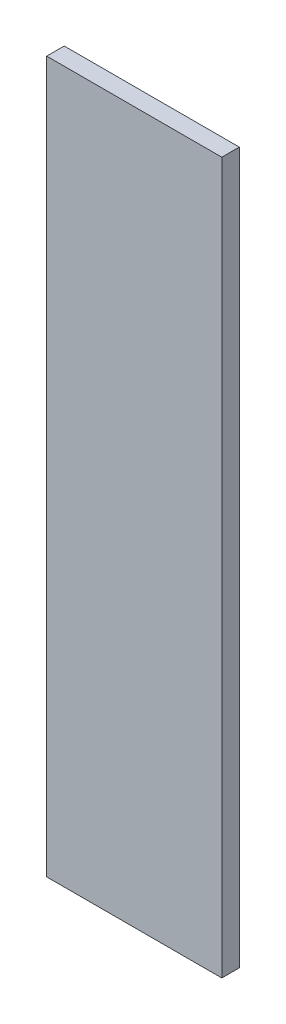
ISO-10303-21;
HEADER;
FILE_DESCRIPTION(('STEP AP214'),'2;1');
FILE_NAME('part.step','',(''),(''),'','','');
FILE_SCHEMA(('AUTOMOTIVE_DESIGN { 1 0 10303 214 1 1 1 1 }'));
ENDSEC;
DATA;
#1=APPLICATION_CONTEXT('core data for automotive mechanical design processes');
#2=APPLICATION_PROTOCOL_DEFINITION('international standard','automotive_design',2000,#1);
#3=PRODUCT_CONTEXT('',#1,'mechanical');
#4=PRODUCT('Part','Part','',(#3));
#5=PRODUCT_RELATED_PRODUCT_CATEGORY('part','',(#4));
#6=PRODUCT_DEFINITION_FORMATION('','',#4);
#7=PRODUCT_DEFINITION_CONTEXT('part definition',#1,'design');
#8=PRODUCT_DEFINITION('design','',#6,#7);
#9=PRODUCT_DEFINITION_SHAPE('','',#8);
#10=(LENGTH_UNIT() NAMED_UNIT(*) SI_UNIT(.MILLI.,.METRE.));
#11=(NAMED_UNIT(*) PLANE_ANGLE_UNIT() SI_UNIT($,.RADIAN.));
#12=(NAMED_UNIT(*) SI_UNIT($,.STERADIAN.) SOLID_ANGLE_UNIT());
#13=UNCERTAINTY_MEASURE_WITH_UNIT(LENGTH_MEASURE(1.E-05),#10,'distance_accuracy_value','');
#14=(GEOMETRIC_REPRESENTATION_CONTEXT(3) GLOBAL_UNCERTAINTY_ASSIGNED_CONTEXT((#13)) GLOBAL_UNIT_ASSIGNED_CONTEXT((#10,
#11,#12)) REPRESENTATION_CONTEXT('',''));
#15=CARTESIAN_POINT('',(0.,0.,0.));
#16=DIRECTION('',(0.,0.,1.));
#17=DIRECTION('',(1.,0.,0.));
#18=AXIS2_PLACEMENT_3D('',#15,#16,#17);
#19=CARTESIAN_POINT('',(0.,0.,25.));
#20=DIRECTION('',(1.,0.,0.));
#21=DIRECTION('',(0.,0.,-1.));
#22=AXIS2_PLACEMENT_3D('',#19,#20,#21);
#23=PLANE('',#22);
#24=DIRECTION('',(0.,-1.,0.));
#25=VECTOR('',#24,1.);
#26=CARTESIAN_POINT('',(0.,0.,0.));
#27=LINE('',#26,#25);
#28=CARTESIAN_POINT('',(0.,1015.,0.));
#29=VERTEX_POINT('',#28);
#30=CARTESIAN_POINT('',(0.,0.,0.));
#31=VERTEX_POINT('',#30);
#32=EDGE_CURVE('E111',#29,#31,#27,.T.);
#33=ORIENTED_EDGE('',*,*,#32,.T.);
#34=DIRECTION('',(0.,0.,-1.));
#35=VECTOR('',#34,1.);
#36=CARTESIAN_POINT('',(0.,0.,25.));
#37=LINE('',#36,#35);
#38=CARTESIAN_POINT('',(0.,0.,25.));
#39=VERTEX_POINT('',#38);
#40=EDGE_CURVE('E11',#39,#31,#37,.T.);
#41=ORIENTED_EDGE('',*,*,#40,.F.);
#42=DIRECTION('',(0.,-1.,0.));
#43=VECTOR('',#42,1.);
#44=CARTESIAN_POINT('',(0.,0.,25.));
#45=LINE('',#44,#43);
#46=CARTESIAN_POINT('',(0.,1015.,25.));
#47=VERTEX_POINT('',#46);
#48=EDGE_CURVE('E95',#47,#39,#45,.T.);
#49=ORIENTED_EDGE('',*,*,#48,.F.);
#50=DIRECTION('',(0.,0.,-1.));
#51=VECTOR('',#50,1.);
#52=CARTESIAN_POINT('',(0.,1015.,25.));
#53=LINE('',#52,#51);
#54=EDGE_CURVE('E107',#47,#29,#53,.T.);
#55=ORIENTED_EDGE('',*,*,#54,.T.);
#56=EDGE_LOOP('',(#33,#41,#49,#55));
#57=FACE_BOUND('',#56,.T.);
#58=ADVANCED_FACE('F43',(#57),#23,.F.);
#59=CARTESIAN_POINT('',(0.,0.,25.));
#60=DIRECTION('',(0.,1.,0.));
#61=DIRECTION('',(0.,0.,1.));
#62=AXIS2_PLACEMENT_3D('',#59,#60,#61);
#63=PLANE('',#62);
#64=DIRECTION('',(1.,0.,0.));
#65=VECTOR('',#64,1.);
#66=CARTESIAN_POINT('',(0.,0.,0.));
#67=LINE('',#66,#65);
#68=CARTESIAN_POINT('',(250.,0.,0.));
#69=VERTEX_POINT('',#68);
#70=EDGE_CURVE('E100',#31,#69,#67,.T.);
#71=ORIENTED_EDGE('',*,*,#70,.T.);
#72=DIRECTION('',(0.,0.,-1.));
#73=VECTOR('',#72,1.);
#74=CARTESIAN_POINT('',(250.,0.,25.));
#75=LINE('',#74,#73);
#76=CARTESIAN_POINT('',(250.,0.,25.));
#77=VERTEX_POINT('',#76);
#78=EDGE_CURVE('E52',#77,#69,#75,.T.);
#79=ORIENTED_EDGE('',*,*,#78,.F.);
#80=DIRECTION('',(1.,0.,0.));
#81=VECTOR('',#80,1.);
#82=CARTESIAN_POINT('',(0.,0.,25.));
#83=LINE('',#82,#81);
#84=EDGE_CURVE('E90',#39,#77,#83,.T.);
#85=ORIENTED_EDGE('',*,*,#84,.F.);
#86=ORIENTED_EDGE('',*,*,#40,.T.);
#87=EDGE_LOOP('',(#71,#79,#85,#86));
#88=FACE_BOUND('',#87,.T.);
#89=ADVANCED_FACE('F99',(#88),#63,.F.);
#90=CARTESIAN_POINT('',(250.,0.,25.));
#91=DIRECTION('',(-1.,0.,0.));
#92=DIRECTION('',(0.,0.,1.));
#93=AXIS2_PLACEMENT_3D('',#90,#91,#92);
#94=PLANE('',#93);
#95=DIRECTION('',(0.,1.,0.));
#96=VECTOR('',#95,1.);
#97=CARTESIAN_POINT('',(250.,0.,0.));
#98=LINE('',#97,#96);
#99=CARTESIAN_POINT('',(250.,1015.,0.));
#100=VERTEX_POINT('',#99);
#101=EDGE_CURVE('E77',#69,#100,#98,.T.);
#102=ORIENTED_EDGE('',*,*,#101,.T.);
#103=DIRECTION('',(0.,0.,-1.));
#104=VECTOR('',#103,1.);
#105=CARTESIAN_POINT('',(250.,1015.,25.));
#106=LINE('',#105,#104);
#107=CARTESIAN_POINT('',(250.,1015.,25.));
#108=VERTEX_POINT('',#107);
#109=EDGE_CURVE('E102',#108,#100,#106,.T.);
#110=ORIENTED_EDGE('',*,*,#109,.F.);
#111=DIRECTION('',(0.,1.,0.));
#112=VECTOR('',#111,1.);
#113=CARTESIAN_POINT('',(250.,0.,25.));
#114=LINE('',#113,#112);
#115=EDGE_CURVE('E93',#77,#108,#114,.T.);
#116=ORIENTED_EDGE('',*,*,#115,.F.);
#117=ORIENTED_EDGE('',*,*,#78,.T.);
#118=EDGE_LOOP('',(#102,#110,#116,#117));
#119=FACE_BOUND('',#118,.T.);
#120=ADVANCED_FACE('F103',(#119),#94,.F.);
#121=CARTESIAN_POINT('',(0.,1015.,25.));
#122=DIRECTION('',(0.,-1.,0.));
#123=DIRECTION('',(0.,0.,-1.));
#124=AXIS2_PLACEMENT_3D('',#121,#122,#123);
#125=PLANE('',#124);
#126=DIRECTION('',(-1.,0.,0.));
#127=VECTOR('',#126,1.);
#128=CARTESIAN_POINT('',(0.,1015.,0.));
#129=LINE('',#128,#127);
#130=EDGE_CURVE('E83',#100,#29,#129,.T.);
#131=ORIENTED_EDGE('',*,*,#130,.T.);
#132=ORIENTED_EDGE('',*,*,#54,.F.);
#133=DIRECTION('',(-1.,0.,0.));
#134=VECTOR('',#133,1.);
#135=CARTESIAN_POINT('',(0.,1015.,25.));
#136=LINE('',#135,#134);
#137=EDGE_CURVE('E60',#108,#47,#136,.T.);
#138=ORIENTED_EDGE('',*,*,#137,.F.);
#139=ORIENTED_EDGE('',*,*,#109,.T.);
#140=EDGE_LOOP('',(#131,#132,#138,#139));
#141=FACE_BOUND('',#140,.T.);
#142=ADVANCED_FACE('F124',(#141),#125,.F.);
#143=CARTESIAN_POINT('',(0.,0.,25.));
#144=DIRECTION('',(0.,0.,-1.));
#145=DIRECTION('',(-1.,0.,0.));
#146=AXIS2_PLACEMENT_3D('',#143,#144,#145);
#147=PLANE('',#146);
#148=ORIENTED_EDGE('',*,*,#48,.T.);
#149=ORIENTED_EDGE('',*,*,#84,.T.);
#150=ORIENTED_EDGE('',*,*,#115,.T.);
#151=ORIENTED_EDGE('',*,*,#137,.T.);
#152=EDGE_LOOP('',(#148,#149,#150,#151));
#153=FACE_BOUND('',#152,.T.);
#154=ADVANCED_FACE('F91',(#153),#147,.F.);
#155=CARTESIAN_POINT('',(0.,0.,0.));
#156=DIRECTION('',(0.,0.,-1.));
#157=DIRECTION('',(-1.,0.,0.));
#158=AXIS2_PLACEMENT_3D('',#155,#156,#157);
#159=PLANE('',#158);
#160=ORIENTED_EDGE('',*,*,#32,.F.);
#161=ORIENTED_EDGE('',*,*,#130,.F.);
#162=ORIENTED_EDGE('',*,*,#101,.F.);
#163=ORIENTED_EDGE('',*,*,#70,.F.);
#164=EDGE_LOOP('',(#160,#161,#162,#163));
#165=FACE_BOUND('',#164,.T.);
#166=ADVANCED_FACE('F127',(#165),#159,.T.);
#167=CLOSED_SHELL('',(#58,#89,#120,#142,#154,#166));
#168=MANIFOLD_SOLID_BREP('B2',#167);
#169=ADVANCED_BREP_SHAPE_REPRESENTATION('',(#18,#168),#14);
#170=SHAPE_DEFINITION_REPRESENTATION(#9,#169);
ENDSEC;
END-ISO-10303-21;
